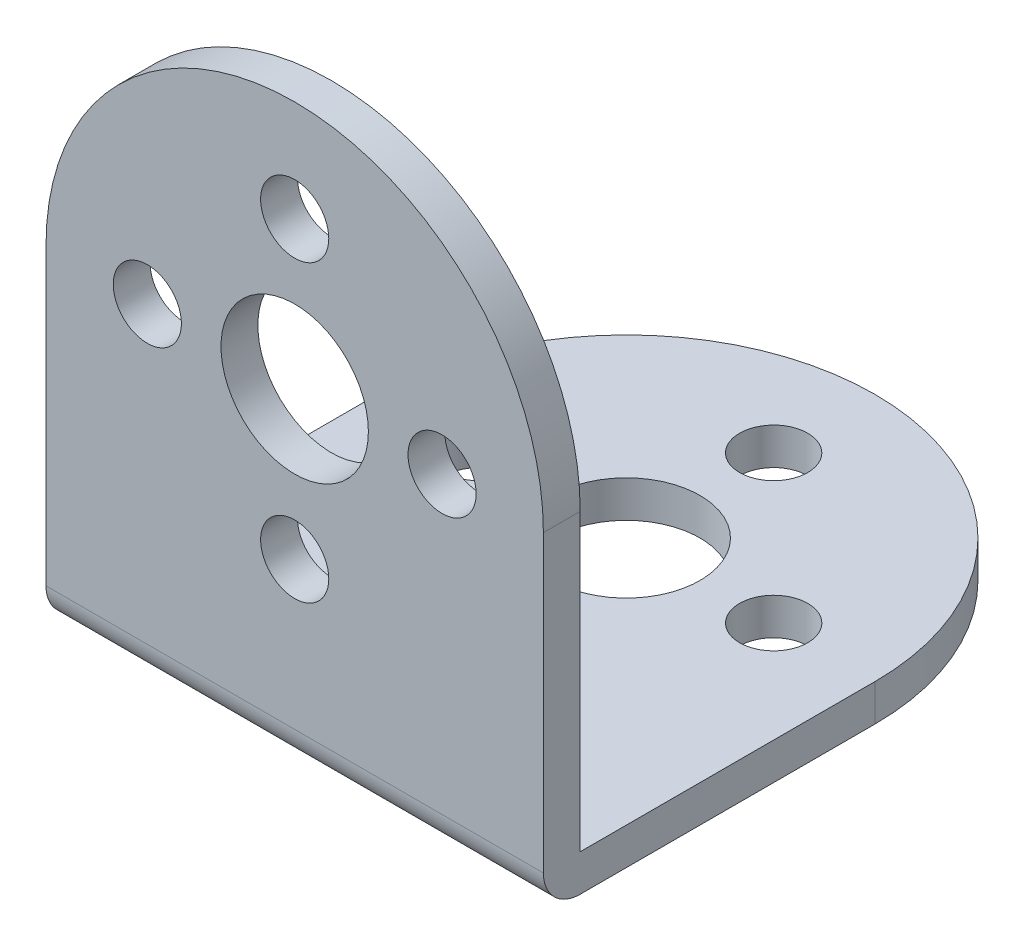
ISO-10303-21;
HEADER;
FILE_DESCRIPTION(('STEP AP214'),'2;1');
FILE_NAME('part.step','',(''),(''),'','','');
FILE_SCHEMA(('AUTOMOTIVE_DESIGN { 1 0 10303 214 1 1 1 1 }'));
ENDSEC;
DATA;
#1=APPLICATION_CONTEXT('core data for automotive mechanical design processes');
#2=APPLICATION_PROTOCOL_DEFINITION('international standard','automotive_design',2000,#1);
#3=PRODUCT_CONTEXT('',#1,'mechanical');
#4=PRODUCT('Part','Part','',(#3));
#5=PRODUCT_RELATED_PRODUCT_CATEGORY('part','',(#4));
#6=PRODUCT_DEFINITION_FORMATION('','',#4);
#7=PRODUCT_DEFINITION_CONTEXT('part definition',#1,'design');
#8=PRODUCT_DEFINITION('design','',#6,#7);
#9=PRODUCT_DEFINITION_SHAPE('','',#8);
#10=(LENGTH_UNIT() NAMED_UNIT(*) SI_UNIT(.MILLI.,.METRE.));
#11=(NAMED_UNIT(*) PLANE_ANGLE_UNIT() SI_UNIT($,.RADIAN.));
#12=(NAMED_UNIT(*) SI_UNIT($,.STERADIAN.) SOLID_ANGLE_UNIT());
#13=UNCERTAINTY_MEASURE_WITH_UNIT(LENGTH_MEASURE(1.E-05),#10,'distance_accuracy_value','');
#14=(GEOMETRIC_REPRESENTATION_CONTEXT(3) GLOBAL_UNCERTAINTY_ASSIGNED_CONTEXT((#13)) GLOBAL_UNIT_ASSIGNED_CONTEXT((#10,
#11,#12)) REPRESENTATION_CONTEXT('',''));
#15=CARTESIAN_POINT('',(0.,0.,0.));
#16=DIRECTION('',(0.,0.,1.));
#17=DIRECTION('',(1.,0.,0.));
#18=AXIS2_PLACEMENT_3D('',#15,#16,#17);
#19=CARTESIAN_POINT('',(0.,0.,-18.));
#20=DIRECTION('',(0.,1.,0.));
#21=DIRECTION('',(0.,0.,1.));
#22=AXIS2_PLACEMENT_3D('',#19,#20,#21);
#23=CYLINDRICAL_SURFACE('',#22,4.);
#24=CARTESIAN_POINT('',(0.,0.,-18.));
#25=DIRECTION('',(0.,1.,0.));
#26=DIRECTION('',(0.,0.,1.));
#27=AXIS2_PLACEMENT_3D('',#24,#25,#26);
#28=CIRCLE('',#27,4.);
#29=CARTESIAN_POINT('',(0.,0.,-14.));
#30=VERTEX_POINT('',#29);
#31=EDGE_CURVE('E19',#30,#30,#28,.T.);
#32=ORIENTED_EDGE('',*,*,#31,.F.);
#33=EDGE_LOOP('',(#32));
#34=FACE_BOUND('',#33,.T.);
#35=CARTESIAN_POINT('',(0.,2.,-18.));
#36=DIRECTION('',(0.,1.,0.));
#37=DIRECTION('',(0.,0.,1.));
#38=AXIS2_PLACEMENT_3D('',#35,#36,#37);
#39=CIRCLE('',#38,4.);
#40=CARTESIAN_POINT('',(0.,2.,-14.));
#41=VERTEX_POINT('',#40);
#42=EDGE_CURVE('E160',#41,#41,#39,.F.);
#43=ORIENTED_EDGE('',*,*,#42,.F.);
#44=EDGE_LOOP('',(#43));
#45=FACE_BOUND('',#44,.T.);
#46=ADVANCED_FACE('F16',(#34,#45),#23,.F.);
#47=CARTESIAN_POINT('',(0.,0.,-26.));
#48=DIRECTION('',(0.,1.,0.));
#49=DIRECTION('',(0.,0.,1.));
#50=AXIS2_PLACEMENT_3D('',#47,#48,#49);
#51=CYLINDRICAL_SURFACE('',#50,1.85);
#52=CARTESIAN_POINT('',(0.,0.,-26.));
#53=DIRECTION('',(0.,1.,0.));
#54=DIRECTION('',(0.,0.,1.));
#55=AXIS2_PLACEMENT_3D('',#52,#53,#54);
#56=CIRCLE('',#55,1.85);
#57=CARTESIAN_POINT('',(0.,0.,-24.15));
#58=VERTEX_POINT('',#57);
#59=EDGE_CURVE('E173',#58,#58,#56,.T.);
#60=ORIENTED_EDGE('',*,*,#59,.F.);
#61=EDGE_LOOP('',(#60));
#62=FACE_BOUND('',#61,.T.);
#63=CARTESIAN_POINT('',(0.,2.,-26.));
#64=DIRECTION('',(0.,1.,0.));
#65=DIRECTION('',(0.,0.,1.));
#66=AXIS2_PLACEMENT_3D('',#63,#64,#65);
#67=CIRCLE('',#66,1.85);
#68=CARTESIAN_POINT('',(0.,2.,-24.15));
#69=VERTEX_POINT('',#68);
#70=EDGE_CURVE('E157',#69,#69,#67,.F.);
#71=ORIENTED_EDGE('',*,*,#70,.F.);
#72=EDGE_LOOP('',(#71));
#73=FACE_BOUND('',#72,.T.);
#74=ADVANCED_FACE('F183',(#62,#73),#51,.F.);
#75=CARTESIAN_POINT('',(8.,0.,-18.));
#76=DIRECTION('',(0.,1.,0.));
#77=DIRECTION('',(0.,0.,1.));
#78=AXIS2_PLACEMENT_3D('',#75,#76,#77);
#79=CYLINDRICAL_SURFACE('',#78,1.85);
#80=CARTESIAN_POINT('',(8.,0.,-18.));
#81=DIRECTION('',(0.,1.,0.));
#82=DIRECTION('',(0.,0.,1.));
#83=AXIS2_PLACEMENT_3D('',#80,#81,#82);
#84=CIRCLE('',#83,1.85);
#85=CARTESIAN_POINT('',(8.,0.,-16.15));
#86=VERTEX_POINT('',#85);
#87=EDGE_CURVE('E171',#86,#86,#84,.T.);
#88=ORIENTED_EDGE('',*,*,#87,.F.);
#89=EDGE_LOOP('',(#88));
#90=FACE_BOUND('',#89,.T.);
#91=CARTESIAN_POINT('',(8.,2.,-18.));
#92=DIRECTION('',(0.,1.,0.));
#93=DIRECTION('',(0.,0.,1.));
#94=AXIS2_PLACEMENT_3D('',#91,#92,#93);
#95=CIRCLE('',#94,1.85);
#96=CARTESIAN_POINT('',(8.,2.,-16.15));
#97=VERTEX_POINT('',#96);
#98=EDGE_CURVE('E154',#97,#97,#95,.F.);
#99=ORIENTED_EDGE('',*,*,#98,.F.);
#100=EDGE_LOOP('',(#99));
#101=FACE_BOUND('',#100,.T.);
#102=ADVANCED_FACE('F365',(#90,#101),#79,.F.);
#103=CARTESIAN_POINT('',(0.,0.,-10.));
#104=DIRECTION('',(0.,1.,0.));
#105=DIRECTION('',(0.,0.,1.));
#106=AXIS2_PLACEMENT_3D('',#103,#104,#105);
#107=CYLINDRICAL_SURFACE('',#106,1.85);
#108=CARTESIAN_POINT('',(0.,0.,-10.));
#109=DIRECTION('',(0.,1.,0.));
#110=DIRECTION('',(0.,0.,1.));
#111=AXIS2_PLACEMENT_3D('',#108,#109,#110);
#112=CIRCLE('',#111,1.85);
#113=CARTESIAN_POINT('',(0.,0.,-8.15));
#114=VERTEX_POINT('',#113);
#115=EDGE_CURVE('E168',#114,#114,#112,.T.);
#116=ORIENTED_EDGE('',*,*,#115,.F.);
#117=EDGE_LOOP('',(#116));
#118=FACE_BOUND('',#117,.T.);
#119=CARTESIAN_POINT('',(0.,2.,-10.));
#120=DIRECTION('',(0.,1.,0.));
#121=DIRECTION('',(0.,0.,1.));
#122=AXIS2_PLACEMENT_3D('',#119,#120,#121);
#123=CIRCLE('',#122,1.85);
#124=CARTESIAN_POINT('',(0.,2.,-8.15));
#125=VERTEX_POINT('',#124);
#126=EDGE_CURVE('E151',#125,#125,#123,.F.);
#127=ORIENTED_EDGE('',*,*,#126,.F.);
#128=EDGE_LOOP('',(#127));
#129=FACE_BOUND('',#128,.T.);
#130=ADVANCED_FACE('F356',(#118,#129),#107,.F.);
#131=CARTESIAN_POINT('',(-8.,0.,-18.));
#132=DIRECTION('',(0.,1.,0.));
#133=DIRECTION('',(0.,0.,1.));
#134=AXIS2_PLACEMENT_3D('',#131,#132,#133);
#135=CYLINDRICAL_SURFACE('',#134,1.85);
#136=CARTESIAN_POINT('',(-8.,0.,-18.));
#137=DIRECTION('',(0.,1.,0.));
#138=DIRECTION('',(0.,0.,1.));
#139=AXIS2_PLACEMENT_3D('',#136,#137,#138);
#140=CIRCLE('',#139,1.85);
#141=CARTESIAN_POINT('',(-8.,0.,-16.15));
#142=VERTEX_POINT('',#141);
#143=EDGE_CURVE('E85',#142,#142,#140,.T.);
#144=ORIENTED_EDGE('',*,*,#143,.F.);
#145=EDGE_LOOP('',(#144));
#146=FACE_BOUND('',#145,.T.);
#147=CARTESIAN_POINT('',(-8.,2.,-18.));
#148=DIRECTION('',(0.,1.,0.));
#149=DIRECTION('',(0.,0.,1.));
#150=AXIS2_PLACEMENT_3D('',#147,#148,#149);
#151=CIRCLE('',#150,1.85);
#152=CARTESIAN_POINT('',(-8.,2.,-16.15));
#153=VERTEX_POINT('',#152);
#154=EDGE_CURVE('E148',#153,#153,#151,.F.);
#155=ORIENTED_EDGE('',*,*,#154,.F.);
#156=EDGE_LOOP('',(#155));
#157=FACE_BOUND('',#156,.T.);
#158=ADVANCED_FACE('F347',(#146,#157),#135,.F.);
#159=CARTESIAN_POINT('',(-13.5,0.,0.));
#160=DIRECTION('',(0.,-1.,0.));
#161=DIRECTION('',(0.,0.,-1.));
#162=AXIS2_PLACEMENT_3D('',#159,#160,#161);
#163=PLANE('',#162);
#164=ORIENTED_EDGE('',*,*,#143,.T.);
#165=EDGE_LOOP('',(#164));
#166=FACE_BOUND('',#165,.T.);
#167=ORIENTED_EDGE('',*,*,#115,.T.);
#168=EDGE_LOOP('',(#167));
#169=FACE_BOUND('',#168,.T.);
#170=ORIENTED_EDGE('',*,*,#87,.T.);
#171=EDGE_LOOP('',(#170));
#172=FACE_BOUND('',#171,.T.);
#173=ORIENTED_EDGE('',*,*,#59,.T.);
#174=EDGE_LOOP('',(#173));
#175=FACE_BOUND('',#174,.T.);
#176=ORIENTED_EDGE('',*,*,#31,.T.);
#177=EDGE_LOOP('',(#176));
#178=FACE_BOUND('',#177,.T.);
#179=CARTESIAN_POINT('',(0.,0.,-18.));
#180=DIRECTION('',(0.,1.,0.));
#181=DIRECTION('',(0.,0.,1.));
#182=AXIS2_PLACEMENT_3D('',#179,#180,#181);
#183=CIRCLE('',#182,13.5);
#184=CARTESIAN_POINT('',(13.5,0.,-18.));
#185=VERTEX_POINT('',#184);
#186=CARTESIAN_POINT('',(-13.5,0.,-18.));
#187=VERTEX_POINT('',#186);
#188=EDGE_CURVE('E74',#185,#187,#183,.T.);
#189=ORIENTED_EDGE('',*,*,#188,.F.);
#190=DIRECTION('',(0.,0.,-1.));
#191=VECTOR('',#190,1.);
#192=CARTESIAN_POINT('',(13.5,0.,0.));
#193=LINE('',#192,#191);
#194=CARTESIAN_POINT('',(13.5,0.,-2.));
#195=VERTEX_POINT('',#194);
#196=EDGE_CURVE('E78',#195,#185,#193,.T.);
#197=ORIENTED_EDGE('',*,*,#196,.F.);
#198=DIRECTION('',(-1.,0.,0.));
#199=VECTOR('',#198,1.);
#200=CARTESIAN_POINT('',(48.6972,0.,-2.));
#201=LINE('',#200,#199);
#202=CARTESIAN_POINT('',(-13.5,0.,-2.));
#203=VERTEX_POINT('',#202);
#204=EDGE_CURVE('E84',#203,#195,#201,.F.);
#205=ORIENTED_EDGE('',*,*,#204,.F.);
#206=DIRECTION('',(0.,0.,-1.));
#207=VECTOR('',#206,1.);
#208=CARTESIAN_POINT('',(-13.5,0.,0.));
#209=LINE('',#208,#207);
#210=EDGE_CURVE('E81',#203,#187,#209,.T.);
#211=ORIENTED_EDGE('',*,*,#210,.T.);
#212=EDGE_LOOP('',(#189,#197,#205,#211));
#213=FACE_BOUND('',#212,.T.);
#214=ADVANCED_FACE('F76',(#166,#169,#172,#175,#178,#213),#163,.T.);
#215=CARTESIAN_POINT('',(0.,-41.0634,-18.));
#216=DIRECTION('',(0.,1.,0.));
#217=DIRECTION('',(0.,0.,1.));
#218=AXIS2_PLACEMENT_3D('',#215,#216,#217);
#219=CYLINDRICAL_SURFACE('',#218,13.5);
#220=ORIENTED_EDGE('',*,*,#188,.T.);
#221=DIRECTION('',(0.,1.,0.));
#222=VECTOR('',#221,1.);
#223=CARTESIAN_POINT('',(-13.5,0.,-18.));
#224=LINE('',#223,#222);
#225=CARTESIAN_POINT('',(-13.5,2.,-18.));
#226=VERTEX_POINT('',#225);
#227=EDGE_CURVE('E111',#187,#226,#224,.T.);
#228=ORIENTED_EDGE('',*,*,#227,.T.);
#229=CARTESIAN_POINT('',(0.,2.,-18.));
#230=DIRECTION('',(0.,1.,0.));
#231=DIRECTION('',(0.,0.,1.));
#232=AXIS2_PLACEMENT_3D('',#229,#230,#231);
#233=CIRCLE('',#232,13.5);
#234=CARTESIAN_POINT('',(13.5,2.,-18.));
#235=VERTEX_POINT('',#234);
#236=EDGE_CURVE('E90',#235,#226,#233,.T.);
#237=ORIENTED_EDGE('',*,*,#236,.F.);
#238=DIRECTION('',(0.,1.,0.));
#239=VECTOR('',#238,1.);
#240=CARTESIAN_POINT('',(13.5,0.,-18.));
#241=LINE('',#240,#239);
#242=EDGE_CURVE('E88',#185,#235,#241,.T.);
#243=ORIENTED_EDGE('',*,*,#242,.F.);
#244=EDGE_LOOP('',(#220,#228,#237,#243));
#245=FACE_BOUND('',#244,.T.);
#246=ADVANCED_FACE('F89',(#245),#219,.T.);
#247=CARTESIAN_POINT('',(48.6972,2.,-2.));
#248=DIRECTION('',(-1.,0.,0.));
#249=DIRECTION('',(0.,0.,1.));
#250=AXIS2_PLACEMENT_3D('',#247,#248,#249);
#251=CYLINDRICAL_SURFACE('',#250,2.);
#252=CARTESIAN_POINT('',(13.5,2.,-2.));
#253=DIRECTION('',(-1.,0.,0.));
#254=DIRECTION('',(0.,0.,1.));
#255=AXIS2_PLACEMENT_3D('',#252,#253,#254);
#256=CIRCLE('',#255,2.);
#257=CARTESIAN_POINT('',(13.5,2.,0.));
#258=VERTEX_POINT('',#257);
#259=EDGE_CURVE('E98',#258,#195,#256,.F.);
#260=ORIENTED_EDGE('',*,*,#259,.F.);
#261=DIRECTION('',(1.,0.,0.));
#262=VECTOR('',#261,1.);
#263=CARTESIAN_POINT('',(-13.5,2.,0.));
#264=LINE('',#263,#262);
#265=CARTESIAN_POINT('',(-13.5,2.,0.));
#266=VERTEX_POINT('',#265);
#267=EDGE_CURVE('E108',#266,#258,#264,.T.);
#268=ORIENTED_EDGE('',*,*,#267,.F.);
#269=CARTESIAN_POINT('',(-13.5,2.,-2.));
#270=DIRECTION('',(-1.,0.,0.));
#271=DIRECTION('',(0.,0.,1.));
#272=AXIS2_PLACEMENT_3D('',#269,#270,#271);
#273=CIRCLE('',#272,2.);
#274=EDGE_CURVE('E144',#266,#203,#273,.F.);
#275=ORIENTED_EDGE('',*,*,#274,.T.);
#276=ORIENTED_EDGE('',*,*,#204,.T.);
#277=EDGE_LOOP('',(#260,#268,#275,#276));
#278=FACE_BOUND('',#277,.T.);
#279=ADVANCED_FACE('F218',(#278),#251,.T.);
#280=CARTESIAN_POINT('',(-13.5,31.5,0.));
#281=DIRECTION('',(0.,0.,1.));
#282=DIRECTION('',(1.,0.,0.));
#283=AXIS2_PLACEMENT_3D('',#280,#281,#282);
#284=PLANE('',#283);
#285=CARTESIAN_POINT('',(-8.,18.,0.));
#286=DIRECTION('',(0.,0.,1.));
#287=DIRECTION('',(1.,0.,0.));
#288=AXIS2_PLACEMENT_3D('',#285,#286,#287);
#289=CIRCLE('',#288,1.85);
#290=CARTESIAN_POINT('',(-6.15,18.,0.));
#291=VERTEX_POINT('',#290);
#292=EDGE_CURVE('E129',#291,#291,#289,.F.);
#293=ORIENTED_EDGE('',*,*,#292,.T.);
#294=EDGE_LOOP('',(#293));
#295=FACE_BOUND('',#294,.T.);
#296=CARTESIAN_POINT('',(0.,10.,0.));
#297=DIRECTION('',(0.,0.,1.));
#298=DIRECTION('',(1.,0.,0.));
#299=AXIS2_PLACEMENT_3D('',#296,#297,#298);
#300=CIRCLE('',#299,1.85);
#301=CARTESIAN_POINT('',(1.85,10.,0.));
#302=VERTEX_POINT('',#301);
#303=EDGE_CURVE('E132',#302,#302,#300,.F.);
#304=ORIENTED_EDGE('',*,*,#303,.T.);
#305=EDGE_LOOP('',(#304));
#306=FACE_BOUND('',#305,.T.);
#307=CARTESIAN_POINT('',(8.,18.,0.));
#308=DIRECTION('',(0.,0.,1.));
#309=DIRECTION('',(1.,0.,0.));
#310=AXIS2_PLACEMENT_3D('',#307,#308,#309);
#311=CIRCLE('',#310,1.85);
#312=CARTESIAN_POINT('',(9.85,18.,0.));
#313=VERTEX_POINT('',#312);
#314=EDGE_CURVE('E135',#313,#313,#311,.F.);
#315=ORIENTED_EDGE('',*,*,#314,.T.);
#316=EDGE_LOOP('',(#315));
#317=FACE_BOUND('',#316,.T.);
#318=CARTESIAN_POINT('',(0.,26.,0.));
#319=DIRECTION('',(0.,0.,1.));
#320=DIRECTION('',(1.,0.,0.));
#321=AXIS2_PLACEMENT_3D('',#318,#319,#320);
#322=CIRCLE('',#321,1.85);
#323=CARTESIAN_POINT('',(1.85,26.,0.));
#324=VERTEX_POINT('',#323);
#325=EDGE_CURVE('E138',#324,#324,#322,.F.);
#326=ORIENTED_EDGE('',*,*,#325,.T.);
#327=EDGE_LOOP('',(#326));
#328=FACE_BOUND('',#327,.T.);
#329=CARTESIAN_POINT('',(0.,18.,0.));
#330=DIRECTION('',(0.,0.,1.));
#331=DIRECTION('',(1.,0.,0.));
#332=AXIS2_PLACEMENT_3D('',#329,#330,#331);
#333=CIRCLE('',#332,4.);
#334=CARTESIAN_POINT('',(4.,18.,0.));
#335=VERTEX_POINT('',#334);
#336=EDGE_CURVE('E141',#335,#335,#333,.F.);
#337=ORIENTED_EDGE('',*,*,#336,.T.);
#338=EDGE_LOOP('',(#337));
#339=FACE_BOUND('',#338,.T.);
#340=CARTESIAN_POINT('',(0.,18.,0.));
#341=DIRECTION('',(0.,0.,1.));
#342=DIRECTION('',(1.,0.,0.));
#343=AXIS2_PLACEMENT_3D('',#340,#341,#342);
#344=CIRCLE('',#343,13.5);
#345=CARTESIAN_POINT('',(-13.5,18.,0.));
#346=VERTEX_POINT('',#345);
#347=CARTESIAN_POINT('',(13.5,18.,0.));
#348=VERTEX_POINT('',#347);
#349=EDGE_CURVE('E100',#346,#348,#344,.F.);
#350=ORIENTED_EDGE('',*,*,#349,.F.);
#351=DIRECTION('',(0.,1.,0.));
#352=VECTOR('',#351,1.);
#353=CARTESIAN_POINT('',(-13.5,0.,0.));
#354=LINE('',#353,#352);
#355=EDGE_CURVE('E147',#346,#266,#354,.F.);
#356=ORIENTED_EDGE('',*,*,#355,.T.);
#357=ORIENTED_EDGE('',*,*,#267,.T.);
#358=DIRECTION('',(0.,1.,0.));
#359=VECTOR('',#358,1.);
#360=CARTESIAN_POINT('',(13.5,0.,0.));
#361=LINE('',#360,#359);
#362=EDGE_CURVE('E104',#348,#258,#361,.F.);
#363=ORIENTED_EDGE('',*,*,#362,.F.);
#364=EDGE_LOOP('',(#350,#356,#357,#363));
#365=FACE_BOUND('',#364,.T.);
#366=ADVANCED_FACE('F216',(#295,#306,#317,#328,#339,#365),#284,.T.);
#367=CARTESIAN_POINT('',(0.,18.,-72.5634));
#368=DIRECTION('',(0.,0.,1.));
#369=DIRECTION('',(1.,0.,0.));
#370=AXIS2_PLACEMENT_3D('',#367,#368,#369);
#371=CYLINDRICAL_SURFACE('',#370,13.5);
#372=CARTESIAN_POINT('',(0.,18.,-2.));
#373=DIRECTION('',(0.,0.,1.));
#374=DIRECTION('',(1.,0.,0.));
#375=AXIS2_PLACEMENT_3D('',#372,#373,#374);
#376=CIRCLE('',#375,13.5);
#377=CARTESIAN_POINT('',(-13.5,18.,-2.));
#378=VERTEX_POINT('',#377);
#379=CARTESIAN_POINT('',(13.5,18.,-2.));
#380=VERTEX_POINT('',#379);
#381=EDGE_CURVE('E125',#378,#380,#376,.F.);
#382=ORIENTED_EDGE('',*,*,#381,.F.);
#383=DIRECTION('',(0.,0.,-1.));
#384=VECTOR('',#383,1.);
#385=CARTESIAN_POINT('',(-13.5,18.,0.));
#386=LINE('',#385,#384);
#387=EDGE_CURVE('E204',#378,#346,#386,.F.);
#388=ORIENTED_EDGE('',*,*,#387,.T.);
#389=ORIENTED_EDGE('',*,*,#349,.T.);
#390=DIRECTION('',(0.,0.,-1.));
#391=VECTOR('',#390,1.);
#392=CARTESIAN_POINT('',(13.5,18.,0.));
#393=LINE('',#392,#391);
#394=EDGE_CURVE('E93',#380,#348,#393,.F.);
#395=ORIENTED_EDGE('',*,*,#394,.F.);
#396=EDGE_LOOP('',(#382,#388,#389,#395));
#397=FACE_BOUND('',#396,.T.);
#398=ADVANCED_FACE('F211',(#397),#371,.T.);
#399=CARTESIAN_POINT('',(13.5,0.,0.));
#400=DIRECTION('',(1.,0.,0.));
#401=DIRECTION('',(0.,0.,-1.));
#402=AXIS2_PLACEMENT_3D('',#399,#400,#401);
#403=PLANE('',#402);
#404=ORIENTED_EDGE('',*,*,#394,.T.);
#405=ORIENTED_EDGE('',*,*,#362,.T.);
#406=ORIENTED_EDGE('',*,*,#259,.T.);
#407=ORIENTED_EDGE('',*,*,#196,.T.);
#408=ORIENTED_EDGE('',*,*,#242,.T.);
#409=DIRECTION('',(0.,0.,1.));
#410=VECTOR('',#409,1.);
#411=CARTESIAN_POINT('',(13.5,2.,-31.5));
#412=LINE('',#411,#410);
#413=CARTESIAN_POINT('',(13.5,2.,-2.));
#414=VERTEX_POINT('',#413);
#415=EDGE_CURVE('E163',#414,#235,#412,.F.);
#416=ORIENTED_EDGE('',*,*,#415,.F.);
#417=DIRECTION('',(0.,1.,0.));
#418=VECTOR('',#417,1.);
#419=CARTESIAN_POINT('',(13.5,2.,-2.));
#420=LINE('',#419,#418);
#421=EDGE_CURVE('E128',#380,#414,#420,.F.);
#422=ORIENTED_EDGE('',*,*,#421,.F.);
#423=EDGE_LOOP('',(#404,#405,#406,#407,#408,#416,#422));
#424=FACE_BOUND('',#423,.T.);
#425=ADVANCED_FACE('F96',(#424),#403,.T.);
#426=CARTESIAN_POINT('',(-13.5,2.,-31.5));
#427=DIRECTION('',(0.,1.,0.));
#428=DIRECTION('',(0.,0.,1.));
#429=AXIS2_PLACEMENT_3D('',#426,#427,#428);
#430=PLANE('',#429);
#431=ORIENTED_EDGE('',*,*,#154,.T.);
#432=EDGE_LOOP('',(#431));
#433=FACE_BOUND('',#432,.T.);
#434=ORIENTED_EDGE('',*,*,#126,.T.);
#435=EDGE_LOOP('',(#434));
#436=FACE_BOUND('',#435,.T.);
#437=ORIENTED_EDGE('',*,*,#98,.T.);
#438=EDGE_LOOP('',(#437));
#439=FACE_BOUND('',#438,.T.);
#440=ORIENTED_EDGE('',*,*,#70,.T.);
#441=EDGE_LOOP('',(#440));
#442=FACE_BOUND('',#441,.T.);
#443=ORIENTED_EDGE('',*,*,#42,.T.);
#444=EDGE_LOOP('',(#443));
#445=FACE_BOUND('',#444,.T.);
#446=DIRECTION('',(-1.,0.,0.));
#447=VECTOR('',#446,1.);
#448=CARTESIAN_POINT('',(-13.5,2.,-2.));
#449=LINE('',#448,#447);
#450=CARTESIAN_POINT('',(-13.5,2.,-2.));
#451=VERTEX_POINT('',#450);
#452=EDGE_CURVE('E192',#414,#451,#449,.T.);
#453=ORIENTED_EDGE('',*,*,#452,.F.);
#454=ORIENTED_EDGE('',*,*,#415,.T.);
#455=ORIENTED_EDGE('',*,*,#236,.T.);
#456=DIRECTION('',(0.,0.,-1.));
#457=VECTOR('',#456,1.);
#458=CARTESIAN_POINT('',(-13.5,2.,0.));
#459=LINE('',#458,#457);
#460=EDGE_CURVE('E34',#226,#451,#459,.F.);
#461=ORIENTED_EDGE('',*,*,#460,.T.);
#462=EDGE_LOOP('',(#453,#454,#455,#461));
#463=FACE_BOUND('',#462,.T.);
#464=ADVANCED_FACE('F186',(#433,#436,#439,#442,#445,#463),#430,.T.);
#465=CARTESIAN_POINT('',(-13.5,0.,0.));
#466=DIRECTION('',(1.,0.,0.));
#467=DIRECTION('',(0.,0.,-1.));
#468=AXIS2_PLACEMENT_3D('',#465,#466,#467);
#469=PLANE('',#468);
#470=ORIENTED_EDGE('',*,*,#355,.F.);
#471=ORIENTED_EDGE('',*,*,#387,.F.);
#472=DIRECTION('',(0.,1.,0.));
#473=VECTOR('',#472,1.);
#474=CARTESIAN_POINT('',(-13.5,2.,-2.));
#475=LINE('',#474,#473);
#476=EDGE_CURVE('E124',#451,#378,#475,.T.);
#477=ORIENTED_EDGE('',*,*,#476,.F.);
#478=ORIENTED_EDGE('',*,*,#460,.F.);
#479=ORIENTED_EDGE('',*,*,#227,.F.);
#480=ORIENTED_EDGE('',*,*,#210,.F.);
#481=ORIENTED_EDGE('',*,*,#274,.F.);
#482=EDGE_LOOP('',(#470,#471,#477,#478,#479,#480,#481));
#483=FACE_BOUND('',#482,.T.);
#484=ADVANCED_FACE('F188',(#483),#469,.F.);
#485=CARTESIAN_POINT('',(0.,18.,0.));
#486=DIRECTION('',(0.,0.,1.));
#487=DIRECTION('',(1.,0.,0.));
#488=AXIS2_PLACEMENT_3D('',#485,#486,#487);
#489=CYLINDRICAL_SURFACE('',#488,4.);
#490=CARTESIAN_POINT('',(0.,18.,-2.));
#491=DIRECTION('',(0.,0.,1.));
#492=DIRECTION('',(1.,0.,0.));
#493=AXIS2_PLACEMENT_3D('',#490,#491,#492);
#494=CIRCLE('',#493,4.);
#495=CARTESIAN_POINT('',(4.,18.,-2.));
#496=VERTEX_POINT('',#495);
#497=EDGE_CURVE('E121',#496,#496,#494,.T.);
#498=ORIENTED_EDGE('',*,*,#497,.F.);
#499=EDGE_LOOP('',(#498));
#500=FACE_BOUND('',#499,.T.);
#501=ORIENTED_EDGE('',*,*,#336,.F.);
#502=EDGE_LOOP('',(#501));
#503=FACE_BOUND('',#502,.T.);
#504=ADVANCED_FACE('F251',(#500,#503),#489,.F.);
#505=CARTESIAN_POINT('',(0.,26.,0.));
#506=DIRECTION('',(0.,0.,1.));
#507=DIRECTION('',(1.,0.,0.));
#508=AXIS2_PLACEMENT_3D('',#505,#506,#507);
#509=CYLINDRICAL_SURFACE('',#508,1.85);
#510=CARTESIAN_POINT('',(0.,26.,-2.));
#511=DIRECTION('',(0.,0.,1.));
#512=DIRECTION('',(1.,0.,0.));
#513=AXIS2_PLACEMENT_3D('',#510,#511,#512);
#514=CIRCLE('',#513,1.85);
#515=CARTESIAN_POINT('',(1.85,26.,-2.));
#516=VERTEX_POINT('',#515);
#517=EDGE_CURVE('E118',#516,#516,#514,.T.);
#518=ORIENTED_EDGE('',*,*,#517,.F.);
#519=EDGE_LOOP('',(#518));
#520=FACE_BOUND('',#519,.T.);
#521=ORIENTED_EDGE('',*,*,#325,.F.);
#522=EDGE_LOOP('',(#521));
#523=FACE_BOUND('',#522,.T.);
#524=ADVANCED_FACE('F247',(#520,#523),#509,.F.);
#525=CARTESIAN_POINT('',(8.,18.,0.));
#526=DIRECTION('',(0.,0.,1.));
#527=DIRECTION('',(1.,0.,0.));
#528=AXIS2_PLACEMENT_3D('',#525,#526,#527);
#529=CYLINDRICAL_SURFACE('',#528,1.85);
#530=CARTESIAN_POINT('',(8.,18.,-2.));
#531=DIRECTION('',(0.,0.,1.));
#532=DIRECTION('',(1.,0.,0.));
#533=AXIS2_PLACEMENT_3D('',#530,#531,#532);
#534=CIRCLE('',#533,1.85);
#535=CARTESIAN_POINT('',(9.85,18.,-2.));
#536=VERTEX_POINT('',#535);
#537=EDGE_CURVE('E115',#536,#536,#534,.T.);
#538=ORIENTED_EDGE('',*,*,#537,.F.);
#539=EDGE_LOOP('',(#538));
#540=FACE_BOUND('',#539,.T.);
#541=ORIENTED_EDGE('',*,*,#314,.F.);
#542=EDGE_LOOP('',(#541));
#543=FACE_BOUND('',#542,.T.);
#544=ADVANCED_FACE('F243',(#540,#543),#529,.F.);
#545=CARTESIAN_POINT('',(0.,10.,0.));
#546=DIRECTION('',(0.,0.,1.));
#547=DIRECTION('',(1.,0.,0.));
#548=AXIS2_PLACEMENT_3D('',#545,#546,#547);
#549=CYLINDRICAL_SURFACE('',#548,1.85);
#550=CARTESIAN_POINT('',(0.,10.,-2.));
#551=DIRECTION('',(0.,0.,1.));
#552=DIRECTION('',(1.,0.,0.));
#553=AXIS2_PLACEMENT_3D('',#550,#551,#552);
#554=CIRCLE('',#553,1.85);
#555=CARTESIAN_POINT('',(1.85,10.,-2.));
#556=VERTEX_POINT('',#555);
#557=EDGE_CURVE('E25',#556,#556,#554,.T.);
#558=ORIENTED_EDGE('',*,*,#557,.F.);
#559=EDGE_LOOP('',(#558));
#560=FACE_BOUND('',#559,.T.);
#561=ORIENTED_EDGE('',*,*,#303,.F.);
#562=EDGE_LOOP('',(#561));
#563=FACE_BOUND('',#562,.T.);
#564=ADVANCED_FACE('F236',(#560,#563),#549,.F.);
#565=CARTESIAN_POINT('',(-8.,18.,0.));
#566=DIRECTION('',(0.,0.,1.));
#567=DIRECTION('',(1.,0.,0.));
#568=AXIS2_PLACEMENT_3D('',#565,#566,#567);
#569=CYLINDRICAL_SURFACE('',#568,1.85);
#570=CARTESIAN_POINT('',(-8.,18.,-2.));
#571=DIRECTION('',(0.,0.,1.));
#572=DIRECTION('',(1.,0.,0.));
#573=AXIS2_PLACEMENT_3D('',#570,#571,#572);
#574=CIRCLE('',#573,1.85);
#575=CARTESIAN_POINT('',(-6.15,18.,-2.));
#576=VERTEX_POINT('',#575);
#577=EDGE_CURVE('E11',#576,#576,#574,.T.);
#578=ORIENTED_EDGE('',*,*,#577,.F.);
#579=EDGE_LOOP('',(#578));
#580=FACE_BOUND('',#579,.T.);
#581=ORIENTED_EDGE('',*,*,#292,.F.);
#582=EDGE_LOOP('',(#581));
#583=FACE_BOUND('',#582,.T.);
#584=ADVANCED_FACE('F230',(#580,#583),#569,.F.);
#585=CARTESIAN_POINT('',(-13.5,2.,-2.));
#586=DIRECTION('',(0.,0.,-1.));
#587=DIRECTION('',(-1.,0.,0.));
#588=AXIS2_PLACEMENT_3D('',#585,#586,#587);
#589=PLANE('',#588);
#590=ORIENTED_EDGE('',*,*,#577,.T.);
#591=EDGE_LOOP('',(#590));
#592=FACE_BOUND('',#591,.T.);
#593=ORIENTED_EDGE('',*,*,#557,.T.);
#594=EDGE_LOOP('',(#593));
#595=FACE_BOUND('',#594,.T.);
#596=ORIENTED_EDGE('',*,*,#537,.T.);
#597=EDGE_LOOP('',(#596));
#598=FACE_BOUND('',#597,.T.);
#599=ORIENTED_EDGE('',*,*,#517,.T.);
#600=EDGE_LOOP('',(#599));
#601=FACE_BOUND('',#600,.T.);
#602=ORIENTED_EDGE('',*,*,#497,.T.);
#603=EDGE_LOOP('',(#602));
#604=FACE_BOUND('',#603,.T.);
#605=ORIENTED_EDGE('',*,*,#452,.T.);
#606=ORIENTED_EDGE('',*,*,#476,.T.);
#607=ORIENTED_EDGE('',*,*,#381,.T.);
#608=ORIENTED_EDGE('',*,*,#421,.T.);
#609=EDGE_LOOP('',(#605,#606,#607,#608));
#610=FACE_BOUND('',#609,.T.);
#611=ADVANCED_FACE('F198',(#592,#595,#598,#601,#604,#610),#589,.T.);
#612=CLOSED_SHELL('',(#46,#74,#102,#130,#158,#214,#246,#279,#366,#398,#425,#464,#484,#504,#524,
#544,#564,#584,#611));
#613=MANIFOLD_SOLID_BREP('B1',#612);
#614=ADVANCED_BREP_SHAPE_REPRESENTATION('',(#18,#613),#14);
#615=SHAPE_DEFINITION_REPRESENTATION(#9,#614);
ENDSEC;
END-ISO-10303-21;
